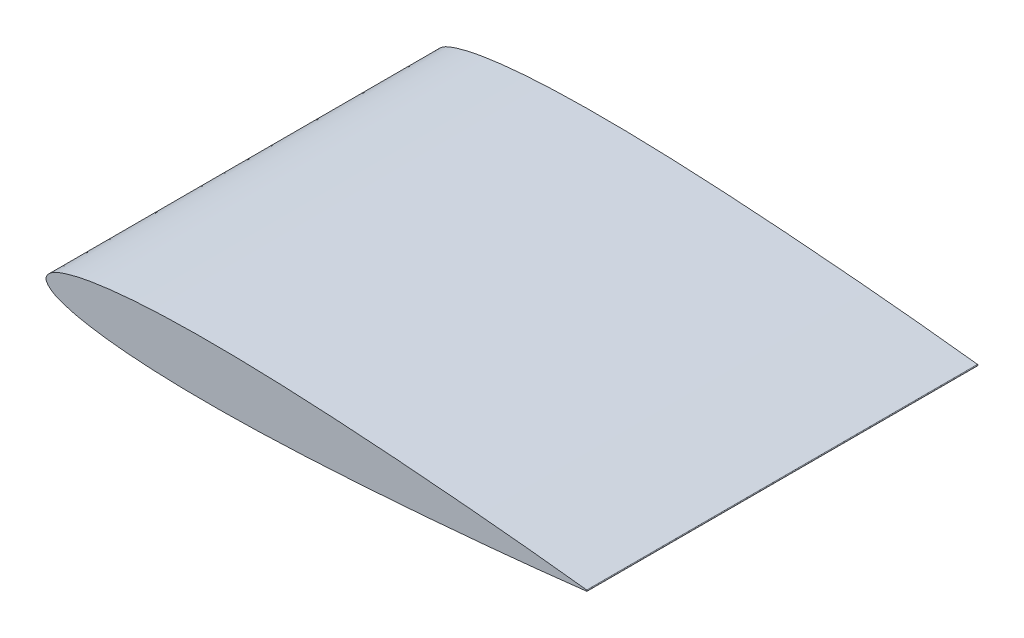
ISO-10303-21;
HEADER;
FILE_DESCRIPTION(('STEP AP214'),'2;1');
FILE_NAME('part.step','',(''),(''),'','','');
FILE_SCHEMA(('AUTOMOTIVE_DESIGN { 1 0 10303 214 1 1 1 1 }'));
ENDSEC;
DATA;
#1=APPLICATION_CONTEXT('core data for automotive mechanical design processes');
#2=APPLICATION_PROTOCOL_DEFINITION('international standard','automotive_design',2000,#1);
#3=PRODUCT_CONTEXT('',#1,'mechanical');
#4=PRODUCT('Part','Part','',(#3));
#5=PRODUCT_RELATED_PRODUCT_CATEGORY('part','',(#4));
#6=PRODUCT_DEFINITION_FORMATION('','',#4);
#7=PRODUCT_DEFINITION_CONTEXT('part definition',#1,'design');
#8=PRODUCT_DEFINITION('design','',#6,#7);
#9=PRODUCT_DEFINITION_SHAPE('','',#8);
#10=(LENGTH_UNIT() NAMED_UNIT(*) SI_UNIT(.MILLI.,.METRE.));
#11=(NAMED_UNIT(*) PLANE_ANGLE_UNIT() SI_UNIT($,.RADIAN.));
#12=(NAMED_UNIT(*) SI_UNIT($,.STERADIAN.) SOLID_ANGLE_UNIT());
#13=UNCERTAINTY_MEASURE_WITH_UNIT(LENGTH_MEASURE(1.E-05),#10,'distance_accuracy_value','');
#14=(GEOMETRIC_REPRESENTATION_CONTEXT(3) GLOBAL_UNCERTAINTY_ASSIGNED_CONTEXT((#13)) GLOBAL_UNIT_ASSIGNED_CONTEXT((#10,
#11,#12)) REPRESENTATION_CONTEXT('',''));
#15=CARTESIAN_POINT('',(0.,0.,0.));
#16=DIRECTION('',(0.,0.,1.));
#17=DIRECTION('',(1.,0.,0.));
#18=AXIS2_PLACEMENT_3D('',#15,#16,#17);
#19=CARTESIAN_POINT('',(84.4,0.08862,61.));
#20=CARTESIAN_POINT('',(82.9935439796052,0.250028542942971,61.));
#21=CARTESIAN_POINT('',(80.1816116313025,0.572733196776617,61.));
#22=CARTESIAN_POINT('',(74.5562427433731,1.17237492609701,61.));
#23=CARTESIAN_POINT('',(67.5244087188227,1.86156568186695,61.));
#24=CARTESIAN_POINT('',(59.0838755827778,2.59195253848784,61.));
#25=CARTESIAN_POINT('',(50.6440452634817,3.22907408250877,61.));
#26=CARTESIAN_POINT('',(42.2040122340682,3.74849444137797,61.));
#27=CARTESIAN_POINT('',(33.7634272471573,4.11807282714425,61.));
#28=CARTESIAN_POINT('',(26.7270322662601,4.24734689962292,61.));
#29=CARTESIAN_POINT('',(21.0989267831112,4.19621074899078,61.));
#30=CARTESIAN_POINT('',(16.8768954340181,4.05734098829501,61.));
#31=CARTESIAN_POINT('',(12.6518578122478,3.78935806437425,61.));
#32=CARTESIAN_POINT('',(9.1336949203026,3.41608663102763,61.));
#33=CARTESIAN_POINT('',(6.31831241692459,2.96858751501449,61.));
#34=CARTESIAN_POINT('',(4.20228212731307,2.53161237631638,61.));
#35=CARTESIAN_POINT('',(2.40315911413954,1.97641666148643,61.));
#36=CARTESIAN_POINT('',(0.911077233193924,1.34831794914571,61.));
#37=CARTESIAN_POINT('',(-0.53949517983725,0.,61.));
#38=CARTESIAN_POINT('',(0.911077233193932,-1.34831794914571,61.));
#39=CARTESIAN_POINT('',(2.40315911413953,-1.97641666148642,61.));
#40=CARTESIAN_POINT('',(4.20228212731308,-2.53161237631638,61.));
#41=CARTESIAN_POINT('',(6.31831241692458,-2.96858751501449,61.));
#42=CARTESIAN_POINT('',(9.1336949203026,-3.41608663102763,61.));
#43=CARTESIAN_POINT('',(12.6518578122478,-3.78935806437425,61.));
#44=CARTESIAN_POINT('',(16.8768954340181,-4.05734098829501,61.));
#45=CARTESIAN_POINT('',(21.0989267831112,-4.19621074899078,61.));
#46=CARTESIAN_POINT('',(26.7270322662601,-4.24734689962292,61.));
#47=CARTESIAN_POINT('',(33.7634272471573,-4.11807282714425,61.));
#48=CARTESIAN_POINT('',(42.2040122340682,-3.74849444137797,61.));
#49=CARTESIAN_POINT('',(50.6440452634817,-3.22907408250877,61.));
#50=CARTESIAN_POINT('',(59.0838755827777,-2.59195253848784,61.));
#51=CARTESIAN_POINT('',(67.5244087188227,-1.86156568186695,61.));
#52=CARTESIAN_POINT('',(74.5562427433731,-1.17237492609701,61.));
#53=CARTESIAN_POINT('',(80.1816116313024,-0.572733196776618,61.));
#54=CARTESIAN_POINT('',(82.9935439796052,-0.250028542942971,61.));
#55=CARTESIAN_POINT('',(84.4,-0.08862,61.));
#56=B_SPLINE_CURVE_WITH_KNOTS('',3,(#19,#20,#21,#22,#23,#24,#25,#26,#27,#28,#29,#30,#31,#32,#33,
#34,#35,#36,#37,#38,#39,#40,#41,#42,#43,#44,#45,#46,#47,#48,#49,#50,#51,#52,#53,#54,#55),
.UNSPECIFIED.,.F.,.F.,(4,1,1,1,1,1,1,1,1,1,1,1,1,1,1,1,1,1,1,1,1,1,1,1,1,1,1,1,1,1,1,1,1,1,4),
(0.,0.0248235560251692,0.0496298207515117,0.0991970800533457,0.148712652883516,
0.198182139774084,0.247604472837194,0.296979942928689,0.34631759583347,0.370984298169999,
0.395664019787251,0.420382181676291,0.445198050680487,0.457689209223658,0.470304282792856,
0.483229229601925,0.4900691736526,0.5,0.5099308263474,0.516770770398075,0.529695717207144,
0.542310790776342,0.554801949319513,0.579617818323709,0.604335980212749,0.629015701830001,
0.65368240416653,0.703020057071311,0.752395527162806,0.801817860225917,0.851287347116484,
0.900802919946654,0.950370179248488,0.975176443974831,1.),.UNSPECIFIED.);
#57=DIRECTION('',(0.,0.,-1.));
#58=VECTOR('',#57,1.);
#59=SURFACE_OF_LINEAR_EXTRUSION('',#56,#58);
#60=CARTESIAN_POINT('',(84.4,0.08862,0.));
#61=CARTESIAN_POINT('',(82.9935439796052,0.250028542942971,0.));
#62=CARTESIAN_POINT('',(80.1816116313025,0.572733196776617,0.));
#63=CARTESIAN_POINT('',(74.5562427433731,1.17237492609701,0.));
#64=CARTESIAN_POINT('',(67.5244087188227,1.86156568186695,0.));
#65=CARTESIAN_POINT('',(59.0838755827778,2.59195253848784,0.));
#66=CARTESIAN_POINT('',(50.6440452634817,3.22907408250877,0.));
#67=CARTESIAN_POINT('',(42.2040122340682,3.74849444137797,0.));
#68=CARTESIAN_POINT('',(33.7634272471573,4.11807282714425,0.));
#69=CARTESIAN_POINT('',(26.7270322662601,4.24734689962292,0.));
#70=CARTESIAN_POINT('',(21.0989267831112,4.19621074899078,0.));
#71=CARTESIAN_POINT('',(16.8768954340181,4.05734098829501,0.));
#72=CARTESIAN_POINT('',(12.6518578122478,3.78935806437425,0.));
#73=CARTESIAN_POINT('',(9.1336949203026,3.41608663102763,0.));
#74=CARTESIAN_POINT('',(6.31831241692459,2.96858751501449,0.));
#75=CARTESIAN_POINT('',(4.20228212731307,2.53161237631638,0.));
#76=CARTESIAN_POINT('',(2.40315911413954,1.97641666148643,0.));
#77=CARTESIAN_POINT('',(0.911077233193924,1.34831794914571,0.));
#78=CARTESIAN_POINT('',(-0.53949517983725,0.,0.));
#79=CARTESIAN_POINT('',(0.911077233193932,-1.34831794914571,0.));
#80=CARTESIAN_POINT('',(2.40315911413953,-1.97641666148642,0.));
#81=CARTESIAN_POINT('',(4.20228212731308,-2.53161237631638,0.));
#82=CARTESIAN_POINT('',(6.31831241692458,-2.96858751501449,0.));
#83=CARTESIAN_POINT('',(9.1336949203026,-3.41608663102763,0.));
#84=CARTESIAN_POINT('',(12.6518578122478,-3.78935806437425,0.));
#85=CARTESIAN_POINT('',(16.8768954340181,-4.05734098829501,0.));
#86=CARTESIAN_POINT('',(21.0989267831112,-4.19621074899078,0.));
#87=CARTESIAN_POINT('',(26.7270322662601,-4.24734689962292,0.));
#88=CARTESIAN_POINT('',(33.7634272471573,-4.11807282714425,0.));
#89=CARTESIAN_POINT('',(42.2040122340682,-3.74849444137797,0.));
#90=CARTESIAN_POINT('',(50.6440452634817,-3.22907408250877,0.));
#91=CARTESIAN_POINT('',(59.0838755827777,-2.59195253848784,0.));
#92=CARTESIAN_POINT('',(67.5244087188227,-1.86156568186695,0.));
#93=CARTESIAN_POINT('',(74.5562427433731,-1.17237492609701,0.));
#94=CARTESIAN_POINT('',(80.1816116313024,-0.572733196776618,0.));
#95=CARTESIAN_POINT('',(82.9935439796052,-0.250028542942971,0.));
#96=CARTESIAN_POINT('',(84.4,-0.08862,0.));
#97=B_SPLINE_CURVE_WITH_KNOTS('',3,(#60,#61,#62,#63,#64,#65,#66,#67,#68,#69,#70,#71,#72,#73,#74,
#75,#76,#77,#78,#79,#80,#81,#82,#83,#84,#85,#86,#87,#88,#89,#90,#91,#92,#93,#94,#95,#96),
.UNSPECIFIED.,.F.,.F.,(4,1,1,1,1,1,1,1,1,1,1,1,1,1,1,1,1,1,1,1,1,1,1,1,1,1,1,1,1,1,1,1,1,1,4),
(0.,0.0248235560251692,0.0496298207515117,0.0991970800533457,0.148712652883516,
0.198182139774084,0.247604472837194,0.296979942928689,0.34631759583347,0.370984298169999,
0.395664019787251,0.420382181676291,0.445198050680487,0.457689209223658,0.470304282792856,
0.483229229601925,0.4900691736526,0.5,0.5099308263474,0.516770770398075,0.529695717207144,
0.542310790776342,0.554801949319513,0.579617818323709,0.604335980212749,0.629015701830001,
0.65368240416653,0.703020057071311,0.752395527162806,0.801817860225917,0.851287347116484,
0.900802919946654,0.950370179248488,0.975176443974831,1.),.UNSPECIFIED.);
#98=CARTESIAN_POINT('',(84.4,0.08862,0.));
#99=VERTEX_POINT('',#98);
#100=CARTESIAN_POINT('',(84.4,-0.08862,0.));
#101=VERTEX_POINT('',#100);
#102=EDGE_CURVE('E65',#99,#101,#97,.T.);
#103=ORIENTED_EDGE('',*,*,#102,.T.);
#104=DIRECTION('',(0.,0.,-1.));
#105=VECTOR('',#104,1.);
#106=CARTESIAN_POINT('',(84.4,-0.08862,61.));
#107=LINE('',#106,#105);
#108=CARTESIAN_POINT('',(84.4,-0.08862,61.));
#109=VERTEX_POINT('',#108);
#110=EDGE_CURVE('E11',#109,#101,#107,.T.);
#111=ORIENTED_EDGE('',*,*,#110,.F.);
#112=CARTESIAN_POINT('',(84.4,0.08862,61.));
#113=VERTEX_POINT('',#112);
#114=EDGE_CURVE('E64',#113,#109,#56,.T.);
#115=ORIENTED_EDGE('',*,*,#114,.F.);
#116=DIRECTION('',(0.,0.,-1.));
#117=VECTOR('',#116,1.);
#118=CARTESIAN_POINT('',(84.4,0.08862,61.));
#119=LINE('',#118,#117);
#120=EDGE_CURVE('E42',#113,#99,#119,.T.);
#121=ORIENTED_EDGE('',*,*,#120,.T.);
#122=EDGE_LOOP('',(#103,#111,#115,#121));
#123=FACE_BOUND('',#122,.T.);
#124=ADVANCED_FACE('F33',(#123),#59,.F.);
#125=CARTESIAN_POINT('',(84.3898297388129,0.,61.));
#126=DIRECTION('',(0.,0.,-1.));
#127=DIRECTION('',(-1.,0.,0.));
#128=AXIS2_PLACEMENT_3D('',#125,#126,#127);
#129=CYLINDRICAL_SURFACE('',#128,0.089201673821819);
#130=CARTESIAN_POINT('',(84.3898297388129,0.,0.));
#131=DIRECTION('',(0.,0.,1.));
#132=DIRECTION('',(-1.,0.,0.));
#133=AXIS2_PLACEMENT_3D('',#130,#131,#132);
#134=CIRCLE('',#133,0.089201673821819);
#135=EDGE_CURVE('E57',#101,#99,#134,.T.);
#136=ORIENTED_EDGE('',*,*,#135,.T.);
#137=ORIENTED_EDGE('',*,*,#120,.F.);
#138=CARTESIAN_POINT('',(84.3898297388129,0.,61.));
#139=DIRECTION('',(0.,0.,1.));
#140=DIRECTION('',(-1.,0.,0.));
#141=AXIS2_PLACEMENT_3D('',#138,#139,#140);
#142=CIRCLE('',#141,0.089201673821819);
#143=EDGE_CURVE('E49',#109,#113,#142,.T.);
#144=ORIENTED_EDGE('',*,*,#143,.F.);
#145=ORIENTED_EDGE('',*,*,#110,.T.);
#146=EDGE_LOOP('',(#136,#137,#144,#145));
#147=FACE_BOUND('',#146,.T.);
#148=ADVANCED_FACE('F60',(#147),#129,.T.);
#149=CARTESIAN_POINT('',(0.,0.,61.));
#150=DIRECTION('',(0.,0.,-1.));
#151=DIRECTION('',(-1.,0.,0.));
#152=AXIS2_PLACEMENT_3D('',#149,#150,#151);
#153=PLANE('',#152);
#154=ORIENTED_EDGE('',*,*,#114,.T.);
#155=ORIENTED_EDGE('',*,*,#143,.T.);
#156=EDGE_LOOP('',(#154,#155));
#157=FACE_BOUND('',#156,.T.);
#158=ADVANCED_FACE('F82',(#157),#153,.F.);
#159=CARTESIAN_POINT('',(0.,0.,0.));
#160=DIRECTION('',(0.,0.,-1.));
#161=DIRECTION('',(-1.,0.,0.));
#162=AXIS2_PLACEMENT_3D('',#159,#160,#161);
#163=PLANE('',#162);
#164=ORIENTED_EDGE('',*,*,#102,.F.);
#165=ORIENTED_EDGE('',*,*,#135,.F.);
#166=EDGE_LOOP('',(#164,#165));
#167=FACE_BOUND('',#166,.T.);
#168=ADVANCED_FACE('F68',(#167),#163,.T.);
#169=CLOSED_SHELL('',(#124,#148,#158,#168));
#170=MANIFOLD_SOLID_BREP('B2',#169);
#171=ADVANCED_BREP_SHAPE_REPRESENTATION('',(#18,#170),#14);
#172=SHAPE_DEFINITION_REPRESENTATION(#9,#171);
ENDSEC;
END-ISO-10303-21;
